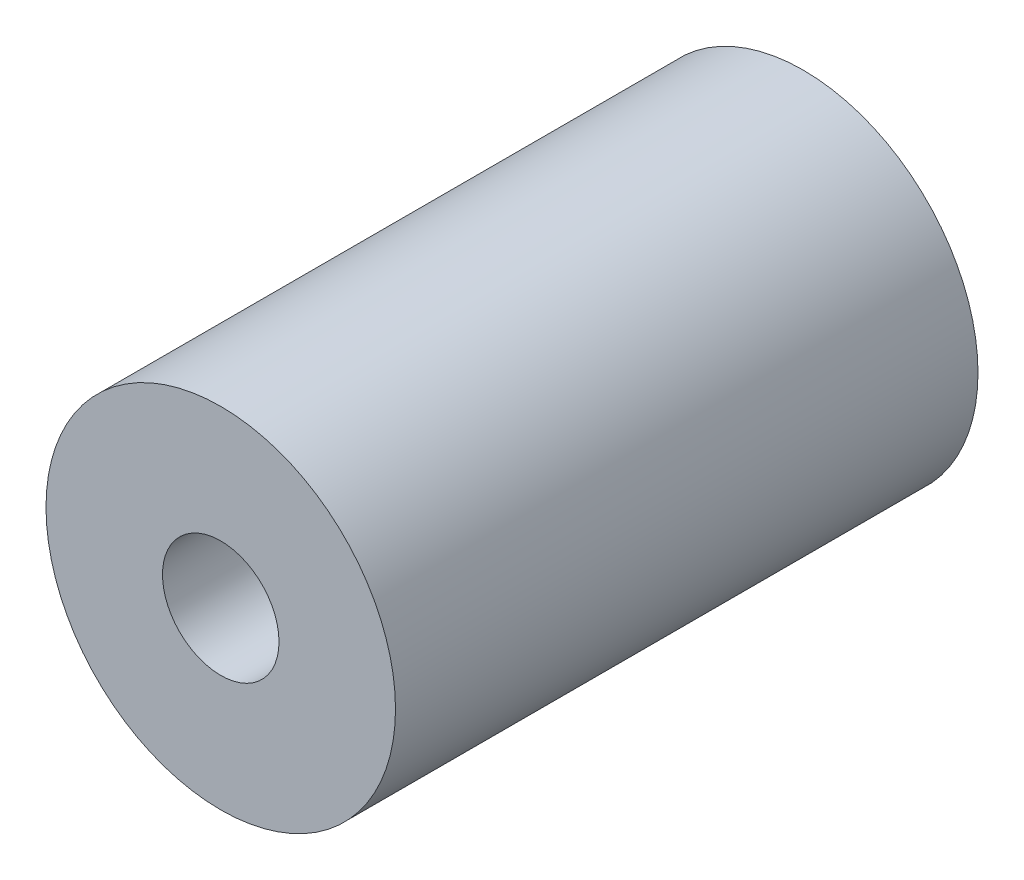
ISO-10303-21;
HEADER;
FILE_DESCRIPTION(('STEP AP214'),'2;1');
FILE_NAME('part.step','',(''),(''),'','','');
FILE_SCHEMA(('AUTOMOTIVE_DESIGN { 1 0 10303 214 1 1 1 1 }'));
ENDSEC;
DATA;
#1=APPLICATION_CONTEXT('core data for automotive mechanical design processes');
#2=APPLICATION_PROTOCOL_DEFINITION('international standard','automotive_design',2000,#1);
#3=PRODUCT_CONTEXT('',#1,'mechanical');
#4=PRODUCT('Part','Part','',(#3));
#5=PRODUCT_RELATED_PRODUCT_CATEGORY('part','',(#4));
#6=PRODUCT_DEFINITION_FORMATION('','',#4);
#7=PRODUCT_DEFINITION_CONTEXT('part definition',#1,'design');
#8=PRODUCT_DEFINITION('design','',#6,#7);
#9=PRODUCT_DEFINITION_SHAPE('','',#8);
#10=(LENGTH_UNIT() NAMED_UNIT(*) SI_UNIT(.MILLI.,.METRE.));
#11=(NAMED_UNIT(*) PLANE_ANGLE_UNIT() SI_UNIT($,.RADIAN.));
#12=(NAMED_UNIT(*) SI_UNIT($,.STERADIAN.) SOLID_ANGLE_UNIT());
#13=UNCERTAINTY_MEASURE_WITH_UNIT(LENGTH_MEASURE(1.E-05),#10,'distance_accuracy_value','');
#14=(GEOMETRIC_REPRESENTATION_CONTEXT(3) GLOBAL_UNCERTAINTY_ASSIGNED_CONTEXT((#13)) GLOBAL_UNIT_ASSIGNED_CONTEXT((#10,
#11,#12)) REPRESENTATION_CONTEXT('',''));
#15=CARTESIAN_POINT('',(0.,0.,0.));
#16=DIRECTION('',(0.,0.,1.));
#17=DIRECTION('',(1.,0.,0.));
#18=AXIS2_PLACEMENT_3D('',#15,#16,#17);
#19=CARTESIAN_POINT('',(0.,0.,10.));
#20=DIRECTION('',(0.,0.,1.));
#21=DIRECTION('',(1.,0.,0.));
#22=AXIS2_PLACEMENT_3D('',#19,#20,#21);
#23=PLANE('',#22);
#24=CARTESIAN_POINT('',(0.,0.,10.));
#25=DIRECTION('',(0.,0.,1.));
#26=DIRECTION('',(1.,0.,0.));
#27=AXIS2_PLACEMENT_3D('',#24,#25,#26);
#28=CIRCLE('',#27,3.);
#29=CARTESIAN_POINT('',(3.,0.,10.));
#30=VERTEX_POINT('',#29);
#31=EDGE_CURVE('E11',#30,#30,#28,.T.);
#32=ORIENTED_EDGE('',*,*,#31,.T.);
#33=EDGE_LOOP('',(#32));
#34=FACE_BOUND('',#33,.T.);
#35=CARTESIAN_POINT('',(0.,0.,10.));
#36=DIRECTION('',(0.,0.,1.));
#37=DIRECTION('',(1.,0.,0.));
#38=AXIS2_PLACEMENT_3D('',#35,#36,#37);
#39=CIRCLE('',#38,1.);
#40=CARTESIAN_POINT('',(1.,0.,10.));
#41=VERTEX_POINT('',#40);
#42=EDGE_CURVE('E48',#41,#41,#39,.T.);
#43=ORIENTED_EDGE('',*,*,#42,.F.);
#44=EDGE_LOOP('',(#43));
#45=FACE_BOUND('',#44,.T.);
#46=ADVANCED_FACE('F37',(#34,#45),#23,.T.);
#47=CARTESIAN_POINT('',(0.,0.,0.));
#48=DIRECTION('',(0.,0.,1.));
#49=DIRECTION('',(1.,0.,0.));
#50=AXIS2_PLACEMENT_3D('',#47,#48,#49);
#51=PLANE('',#50);
#52=CARTESIAN_POINT('',(0.,0.,0.));
#53=DIRECTION('',(0.,0.,1.));
#54=DIRECTION('',(1.,0.,0.));
#55=AXIS2_PLACEMENT_3D('',#52,#53,#54);
#56=CIRCLE('',#55,3.);
#57=CARTESIAN_POINT('',(3.,0.,0.));
#58=VERTEX_POINT('',#57);
#59=EDGE_CURVE('E41',#58,#58,#56,.T.);
#60=ORIENTED_EDGE('',*,*,#59,.F.);
#61=EDGE_LOOP('',(#60));
#62=FACE_BOUND('',#61,.T.);
#63=CARTESIAN_POINT('',(0.,0.,0.));
#64=DIRECTION('',(0.,0.,1.));
#65=DIRECTION('',(1.,0.,0.));
#66=AXIS2_PLACEMENT_3D('',#63,#64,#65);
#67=CIRCLE('',#66,1.);
#68=CARTESIAN_POINT('',(1.,0.,0.));
#69=VERTEX_POINT('',#68);
#70=EDGE_CURVE('E50',#69,#69,#67,.T.);
#71=ORIENTED_EDGE('',*,*,#70,.T.);
#72=EDGE_LOOP('',(#71));
#73=FACE_BOUND('',#72,.T.);
#74=ADVANCED_FACE('F60',(#62,#73),#51,.F.);
#75=CARTESIAN_POINT('',(0.,0.,10.));
#76=DIRECTION('',(0.,0.,-1.));
#77=DIRECTION('',(-1.,0.,0.));
#78=AXIS2_PLACEMENT_3D('',#75,#76,#77);
#79=CYLINDRICAL_SURFACE('',#78,3.);
#80=ORIENTED_EDGE('',*,*,#31,.F.);
#81=EDGE_LOOP('',(#80));
#82=FACE_BOUND('',#81,.T.);
#83=ORIENTED_EDGE('',*,*,#59,.T.);
#84=EDGE_LOOP('',(#83));
#85=FACE_BOUND('',#84,.T.);
#86=ADVANCED_FACE('F39',(#82,#85),#79,.T.);
#87=CARTESIAN_POINT('',(0.,0.,10.));
#88=DIRECTION('',(0.,0.,-1.));
#89=DIRECTION('',(-1.,0.,0.));
#90=AXIS2_PLACEMENT_3D('',#87,#88,#89);
#91=CYLINDRICAL_SURFACE('',#90,1.);
#92=ORIENTED_EDGE('',*,*,#42,.T.);
#93=EDGE_LOOP('',(#92));
#94=FACE_BOUND('',#93,.T.);
#95=ORIENTED_EDGE('',*,*,#70,.F.);
#96=EDGE_LOOP('',(#95));
#97=FACE_BOUND('',#96,.T.);
#98=ADVANCED_FACE('F56',(#94,#97),#91,.F.);
#99=CLOSED_SHELL('',(#46,#74,#86,#98));
#100=MANIFOLD_SOLID_BREP('B2',#99);
#101=ADVANCED_BREP_SHAPE_REPRESENTATION('',(#18,#100),#14);
#102=SHAPE_DEFINITION_REPRESENTATION(#9,#101);
ENDSEC;
END-ISO-10303-21;
